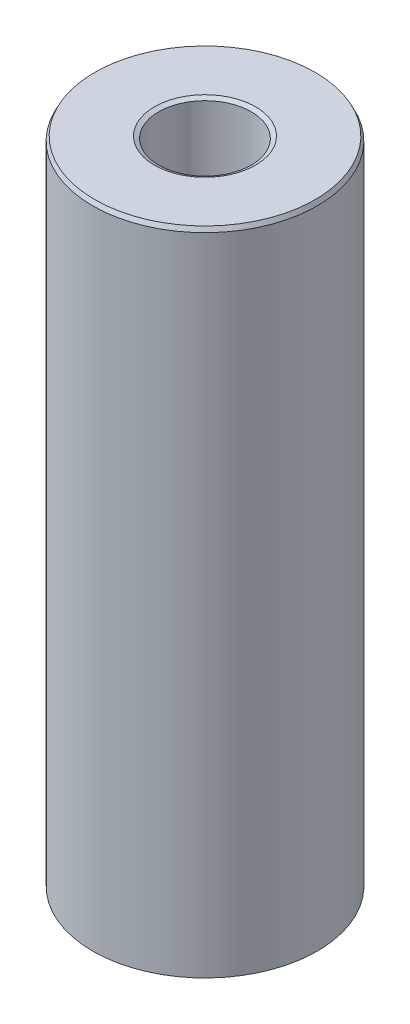
ISO-10303-21;
HEADER;
FILE_DESCRIPTION(('STEP AP214'),'2;1');
FILE_NAME('part.step','',(''),(''),'','','');
FILE_SCHEMA(('AUTOMOTIVE_DESIGN { 1 0 10303 214 1 1 1 1 }'));
ENDSEC;
DATA;
#1=APPLICATION_CONTEXT('core data for automotive mechanical design processes');
#2=APPLICATION_PROTOCOL_DEFINITION('international standard','automotive_design',2000,#1);
#3=PRODUCT_CONTEXT('',#1,'mechanical');
#4=PRODUCT('Part','Part','',(#3));
#5=PRODUCT_RELATED_PRODUCT_CATEGORY('part','',(#4));
#6=PRODUCT_DEFINITION_FORMATION('','',#4);
#7=PRODUCT_DEFINITION_CONTEXT('part definition',#1,'design');
#8=PRODUCT_DEFINITION('design','',#6,#7);
#9=PRODUCT_DEFINITION_SHAPE('','',#8);
#10=(LENGTH_UNIT() NAMED_UNIT(*) SI_UNIT(.MILLI.,.METRE.));
#11=(NAMED_UNIT(*) PLANE_ANGLE_UNIT() SI_UNIT($,.RADIAN.));
#12=(NAMED_UNIT(*) SI_UNIT($,.STERADIAN.) SOLID_ANGLE_UNIT());
#13=UNCERTAINTY_MEASURE_WITH_UNIT(LENGTH_MEASURE(1.E-05),#10,'distance_accuracy_value','');
#14=(GEOMETRIC_REPRESENTATION_CONTEXT(3) GLOBAL_UNCERTAINTY_ASSIGNED_CONTEXT((#13)) GLOBAL_UNIT_ASSIGNED_CONTEXT((#10,
#11,#12)) REPRESENTATION_CONTEXT('',''));
#15=CARTESIAN_POINT('',(0.,0.,0.));
#16=DIRECTION('',(0.,0.,1.));
#17=DIRECTION('',(1.,0.,0.));
#18=AXIS2_PLACEMENT_3D('',#15,#16,#17);
#19=CARTESIAN_POINT('',(0.,188.569213852721,0.));
#20=DIRECTION('',(0.,-1.,0.));
#21=DIRECTION('',(0.,0.,-1.));
#22=AXIS2_PLACEMENT_3D('',#19,#20,#21);
#23=CYLINDRICAL_SURFACE('',#22,32.5);
#24=CARTESIAN_POINT('',(0.,0.614177343072037,0.));
#25=DIRECTION('',(0.,1.,0.));
#26=DIRECTION('',(0.,0.,1.));
#27=AXIS2_PLACEMENT_3D('',#24,#25,#26);
#28=CIRCLE('',#27,32.5);
#29=CARTESIAN_POINT('',(0.,0.614177343072037,32.5));
#30=VERTEX_POINT('',#29);
#31=EDGE_CURVE('E10',#30,#30,#28,.T.);
#32=ORIENTED_EDGE('',*,*,#31,.T.);
#33=EDGE_LOOP('',(#32));
#34=FACE_BOUND('',#33,.T.);
#35=CARTESIAN_POINT('',(0.,187.31958594117,0.));
#36=DIRECTION('',(0.,1.,0.));
#37=DIRECTION('',(0.,0.,1.));
#38=AXIS2_PLACEMENT_3D('',#35,#36,#37);
#39=CIRCLE('',#38,32.5);
#40=CARTESIAN_POINT('',(0.,187.31958594117,32.5));
#41=VERTEX_POINT('',#40);
#42=EDGE_CURVE('E50',#41,#41,#39,.F.);
#43=ORIENTED_EDGE('',*,*,#42,.T.);
#44=EDGE_LOOP('',(#43));
#45=FACE_BOUND('',#44,.T.);
#46=ADVANCED_FACE('F39',(#34,#45),#23,.T.);
#47=CARTESIAN_POINT('',(0.,188.569213852721,0.));
#48=DIRECTION('',(0.,1.,0.));
#49=DIRECTION('',(0.,0.,1.));
#50=AXIS2_PLACEMENT_3D('',#47,#48,#49);
#51=PLANE('',#50);
#52=CARTESIAN_POINT('',(0.,188.569213852721,0.));
#53=DIRECTION('',(0.,1.,0.));
#54=DIRECTION('',(0.,0.,1.));
#55=AXIS2_PLACEMENT_3D('',#52,#53,#54);
#56=CIRCLE('',#55,14.6327961417283);
#57=CARTESIAN_POINT('',(0.,188.569213852721,14.6327961417283));
#58=VERTEX_POINT('',#57);
#59=EDGE_CURVE('E58',#58,#58,#56,.F.);
#60=ORIENTED_EDGE('',*,*,#59,.T.);
#61=EDGE_LOOP('',(#60));
#62=FACE_BOUND('',#61,.T.);
#63=CARTESIAN_POINT('',(0.,188.569213852721,0.));
#64=DIRECTION('',(0.,1.,0.));
#65=DIRECTION('',(0.,0.,1.));
#66=AXIS2_PLACEMENT_3D('',#63,#64,#65);
#67=CIRCLE('',#66,31.8858226569279);
#68=CARTESIAN_POINT('',(0.,188.569213852721,31.8858226569279));
#69=VERTEX_POINT('',#68);
#70=EDGE_CURVE('E61',#69,#69,#67,.T.);
#71=ORIENTED_EDGE('',*,*,#70,.T.);
#72=EDGE_LOOP('',(#71));
#73=FACE_BOUND('',#72,.T.);
#74=ADVANCED_FACE('F88',(#62,#73),#51,.T.);
#75=CARTESIAN_POINT('',(0.,0.,0.));
#76=DIRECTION('',(0.,1.,0.));
#77=DIRECTION('',(0.,0.,1.));
#78=AXIS2_PLACEMENT_3D('',#75,#76,#77);
#79=PLANE('',#78);
#80=CARTESIAN_POINT('',(0.,0.,0.));
#81=DIRECTION('',(0.,1.,0.));
#82=DIRECTION('',(0.,0.,1.));
#83=AXIS2_PLACEMENT_3D('',#80,#81,#82);
#84=CIRCLE('',#83,13.99734557325);
#85=CARTESIAN_POINT('',(0.,0.,13.99734557325));
#86=VERTEX_POINT('',#85);
#87=EDGE_CURVE('E51',#86,#86,#84,.T.);
#88=ORIENTED_EDGE('',*,*,#87,.T.);
#89=EDGE_LOOP('',(#88));
#90=FACE_BOUND('',#89,.T.);
#91=CARTESIAN_POINT('',(0.,0.,0.));
#92=DIRECTION('',(0.,1.,0.));
#93=DIRECTION('',(0.,0.,1.));
#94=AXIS2_PLACEMENT_3D('',#91,#92,#93);
#95=CIRCLE('',#94,31.2503720884496);
#96=CARTESIAN_POINT('',(0.,0.,31.2503720884496));
#97=VERTEX_POINT('',#96);
#98=EDGE_CURVE('E54',#97,#97,#95,.F.);
#99=ORIENTED_EDGE('',*,*,#98,.T.);
#100=EDGE_LOOP('',(#99));
#101=FACE_BOUND('',#100,.T.);
#102=ADVANCED_FACE('F83',(#90,#101),#79,.F.);
#103=CARTESIAN_POINT('',(0.,188.569213852721,0.));
#104=DIRECTION('',(0.,-1.,0.));
#105=DIRECTION('',(0.,0.,-1.));
#106=AXIS2_PLACEMENT_3D('',#103,#104,#105);
#107=CYLINDRICAL_SURFACE('',#106,13.383168230178);
#108=CARTESIAN_POINT('',(0.,187.955036509649,0.));
#109=DIRECTION('',(0.,1.,0.));
#110=DIRECTION('',(0.,0.,1.));
#111=AXIS2_PLACEMENT_3D('',#108,#109,#110);
#112=CIRCLE('',#111,13.383168230178);
#113=CARTESIAN_POINT('',(0.,187.955036509649,13.383168230178));
#114=VERTEX_POINT('',#113);
#115=EDGE_CURVE('E67',#114,#114,#112,.T.);
#116=ORIENTED_EDGE('',*,*,#115,.T.);
#117=EDGE_LOOP('',(#116));
#118=FACE_BOUND('',#117,.T.);
#119=CARTESIAN_POINT('',(0.,1.24962791155039,0.));
#120=DIRECTION('',(0.,1.,0.));
#121=DIRECTION('',(0.,0.,1.));
#122=AXIS2_PLACEMENT_3D('',#119,#120,#121);
#123=CIRCLE('',#122,13.383168230178);
#124=CARTESIAN_POINT('',(0.,1.24962791155039,13.383168230178));
#125=VERTEX_POINT('',#124);
#126=EDGE_CURVE('E69',#125,#125,#123,.F.);
#127=ORIENTED_EDGE('',*,*,#126,.T.);
#128=EDGE_LOOP('',(#127));
#129=FACE_BOUND('',#128,.T.);
#130=ADVANCED_FACE('F71',(#118,#129),#107,.F.);
#131=CARTESIAN_POINT('',(0.,187.955036509649,0.));
#132=DIRECTION('',(0.,1.,0.));
#133=DIRECTION('',(0.,0.,1.));
#134=AXIS2_PLACEMENT_3D('',#131,#132,#133);
#135=CONICAL_SURFACE('',#134,13.383168230178,1.1139813341457);
#136=ORIENTED_EDGE('',*,*,#59,.F.);
#137=EDGE_LOOP('',(#136));
#138=FACE_BOUND('',#137,.T.);
#139=ORIENTED_EDGE('',*,*,#115,.F.);
#140=EDGE_LOOP('',(#139));
#141=FACE_BOUND('',#140,.T.);
#142=ADVANCED_FACE('F77',(#138,#141),#135,.F.);
#143=CARTESIAN_POINT('',(0.,0.,0.));
#144=DIRECTION('',(0.,-1.,0.));
#145=DIRECTION('',(0.,0.,-1.));
#146=AXIS2_PLACEMENT_3D('',#143,#144,#145);
#147=CONICAL_SURFACE('',#146,13.99734557325,0.456814992649182);
#148=ORIENTED_EDGE('',*,*,#126,.F.);
#149=EDGE_LOOP('',(#148));
#150=FACE_BOUND('',#149,.T.);
#151=ORIENTED_EDGE('',*,*,#87,.F.);
#152=EDGE_LOOP('',(#151));
#153=FACE_BOUND('',#152,.T.);
#154=ADVANCED_FACE('F73',(#150,#153),#147,.F.);
#155=CARTESIAN_POINT('',(0.,0.614177343072037,0.));
#156=DIRECTION('',(0.,1.,0.));
#157=DIRECTION('',(0.,0.,1.));
#158=AXIS2_PLACEMENT_3D('',#155,#156,#157);
#159=CONICAL_SURFACE('',#158,32.5,1.11398133414573);
#160=CARTESIAN_POINT('',(0.,0.,31.2503720884496));
#161=CARTESIAN_POINT('',(0.,0.00639768065700028,31.2633890458616));
#162=CARTESIAN_POINT('',(0.,0.0127953613140007,31.2764060032736));
#163=CARTESIAN_POINT('',(0.,0.0255907226280014,31.3024399180976));
#164=CARTESIAN_POINT('',(0.,0.0319884032850018,31.3154568755096));
#165=CARTESIAN_POINT('',(0.,0.0447837645990026,31.3414907903335));
#166=CARTESIAN_POINT('',(0.,0.0511814452560029,31.3545077477455));
#167=CARTESIAN_POINT('',(0.,0.0639768065700037,31.3805416625695));
#168=CARTESIAN_POINT('',(0.,0.0703744872270041,31.3935586199815));
#169=CARTESIAN_POINT('',(0.,0.0831698485410048,31.4195925348054));
#170=CARTESIAN_POINT('',(0.,0.0895675291980052,31.4326094922174));
#171=CARTESIAN_POINT('',(0.,0.102362890512006,31.4586434070414));
#172=CARTESIAN_POINT('',(0.,0.108760571169006,31.4716603644533));
#173=CARTESIAN_POINT('',(0.,0.121555932483007,31.4976942792773));
#174=CARTESIAN_POINT('',(0.,0.127953613140007,31.5107112366893));
#175=CARTESIAN_POINT('',(0.,0.140748974454008,31.5367451515133));
#176=CARTESIAN_POINT('',(0.,0.147146655111009,31.5497621089252));
#177=CARTESIAN_POINT('',(0.,0.159942016425009,31.5757960237492));
#178=CARTESIAN_POINT('',(0.,0.16633969708201,31.5888129811612));
#179=CARTESIAN_POINT('',(0.,0.179135058396011,31.6148468959852));
#180=CARTESIAN_POINT('',(0.,0.185532739053011,31.6278638533971));
#181=CARTESIAN_POINT('',(0.,0.198328100367012,31.6538977682211));
#182=CARTESIAN_POINT('',(0.,0.204725781024012,31.6669147256331));
#183=CARTESIAN_POINT('',(0.,0.217521142338013,31.6929486404571));
#184=CARTESIAN_POINT('',(0.,0.223918822995013,31.705965597869));
#185=CARTESIAN_POINT('',(0.,0.236714184309014,31.731999512693));
#186=CARTESIAN_POINT('',(0.,0.243111864966014,31.745016470105));
#187=CARTESIAN_POINT('',(0.,0.255907226280015,31.771050384929));
#188=CARTESIAN_POINT('',(0.,0.262304906937016,31.7840673423409));
#189=CARTESIAN_POINT('',(0.,0.275100268251016,31.8101012571649));
#190=CARTESIAN_POINT('',(0.,0.281497948908017,31.8231182145769));
#191=CARTESIAN_POINT('',(0.,0.294293310222017,31.8491521294008));
#192=CARTESIAN_POINT('',(0.,0.300690990879018,31.8621690868128));
#193=CARTESIAN_POINT('',(0.,0.313486352193019,31.8882030016368));
#194=CARTESIAN_POINT('',(0.,0.319884032850019,31.9012199590488));
#195=CARTESIAN_POINT('',(0.,0.33267939416402,31.9272538738727));
#196=CARTESIAN_POINT('',(0.,0.33907707482102,31.9402708312847));
#197=CARTESIAN_POINT('',(0.,0.351872436135021,31.9663047461087));
#198=CARTESIAN_POINT('',(0.,0.358270116792021,31.9793217035207));
#199=CARTESIAN_POINT('',(0.,0.371065478106022,32.0053556183446));
#200=CARTESIAN_POINT('',(0.,0.377463158763022,32.0183725757566));
#201=CARTESIAN_POINT('',(0.,0.390258520077023,32.0444064905806));
#202=CARTESIAN_POINT('',(0.,0.396656200734024,32.0574234479926));
#203=CARTESIAN_POINT('',(0.,0.409451562048024,32.0834573628165));
#204=CARTESIAN_POINT('',(0.,0.415849242705025,32.0964743202285));
#205=CARTESIAN_POINT('',(0.,0.428644604019025,32.1225082350525));
#206=CARTESIAN_POINT('',(0.,0.435042284676026,32.1355251924645));
#207=CARTESIAN_POINT('',(0.,0.447837645990027,32.1615591072884));
#208=CARTESIAN_POINT('',(0.,0.454235326647027,32.1745760647004));
#209=CARTESIAN_POINT('',(0.,0.467030687961028,32.2006099795244));
#210=CARTESIAN_POINT('',(0.,0.473428368618028,32.2136269369364));
#211=CARTESIAN_POINT('',(0.,0.486223729932029,32.2396608517603));
#212=CARTESIAN_POINT('',(0.,0.492621410589029,32.2526778091723));
#213=CARTESIAN_POINT('',(0.,0.50541677190303,32.2787117239963));
#214=CARTESIAN_POINT('',(0.,0.51181445256003,32.2917286814083));
#215=CARTESIAN_POINT('',(0.,0.524609813874031,32.3177625962322));
#216=CARTESIAN_POINT('',(0.,0.531007494531032,32.3307795536442));
#217=CARTESIAN_POINT('',(0.,0.543802855845032,32.3568134684682));
#218=CARTESIAN_POINT('',(0.,0.550200536502033,32.3698304258802));
#219=CARTESIAN_POINT('',(0.,0.562995897816033,32.3958643407041));
#220=CARTESIAN_POINT('',(0.,0.569393578473034,32.4088812981161));
#221=CARTESIAN_POINT('',(0.,0.582188939787035,32.4349152129401));
#222=CARTESIAN_POINT('',(0.,0.588586620444035,32.4479321703521));
#223=CARTESIAN_POINT('',(0.,0.601381981758036,32.473966085176));
#224=CARTESIAN_POINT('',(0.,0.607779662415036,32.486983042588));
#225=CARTESIAN_POINT('',(0.,0.614177343072037,32.5));
#226=B_SPLINE_CURVE_WITH_KNOTS('',3,(#160,#161,#162,#163,#164,#165,#166,#167,#168,#169,#170,
#171,#172,#173,#174,#175,#176,#177,#178,#179,#180,#181,#182,#183,#184,#185,#186,#187,#188,#189,
#190,#191,#192,#193,#194,#195,#196,#197,#198,#199,#200,#201,#202,#203,#204,#205,#206,#207,#208,
#209,#210,#211,#212,#213,#214,#215,#216,#217,#218,#219,#220,#221,#222,#223,#224,#225),
.UNSPECIFIED.,.F.,.F.,(4,2,2,2,2,2,2,2,2,2,2,2,2,2,2,2,2,2,2,2,2,2,2,2,2,2,2,2,2,2,2,2,4),(0.,
0.0435125669489749,0.0870251338979497,0.130537700846925,0.174050267795899,0.217562834744874,
0.261075401693849,0.304587968642824,0.348100535591799,0.391613102540774,0.435125669489749,
0.478638236438723,0.522150803387698,0.565663370336673,0.609175937285648,0.652688504234623,
0.696201071183598,0.739713638132573,0.783226205081547,0.826738772030522,0.870251338979497,
0.913763905928472,0.957276472877447,1.00078903982642,1.0443016067754,1.08781417372437,
1.13132674067335,1.17483930762232,1.2183518745713,1.26186444152027,1.30537700846925,
1.34888957541822,1.3924021423672),.UNSPECIFIED.);
#227=EDGE_CURVE('BSEAM76',#97,#30,#226,.T.);
#228=ORIENTED_EDGE('',*,*,#98,.F.);
#229=ORIENTED_EDGE('',*,*,#31,.F.);
#230=ORIENTED_EDGE('',*,*,#227,.T.);
#231=ORIENTED_EDGE('',*,*,#227,.F.);
#232=EDGE_LOOP('',(#228,#230,#229,#231));
#233=FACE_BOUND('',#232,.T.);
#234=ADVANCED_FACE('F76',(#233),#159,.T.);
#235=CARTESIAN_POINT('',(0.,188.569213852721,0.));
#236=DIRECTION('',(0.,-1.,0.));
#237=DIRECTION('',(0.,0.,-1.));
#238=AXIS2_PLACEMENT_3D('',#235,#236,#237);
#239=CONICAL_SURFACE('',#238,31.8858226569279,0.456814992649176);
#240=ORIENTED_EDGE('',*,*,#42,.F.);
#241=EDGE_LOOP('',(#240));
#242=FACE_BOUND('',#241,.T.);
#243=ORIENTED_EDGE('',*,*,#70,.F.);
#244=EDGE_LOOP('',(#243));
#245=FACE_BOUND('',#244,.T.);
#246=ADVANCED_FACE('F45',(#242,#245),#239,.T.);
#247=CLOSED_SHELL('',(#46,#74,#102,#130,#142,#154,#234,#246));
#248=MANIFOLD_SOLID_BREP('B2',#247);
#249=ADVANCED_BREP_SHAPE_REPRESENTATION('',(#18,#248),#14);
#250=SHAPE_DEFINITION_REPRESENTATION(#9,#249);
ENDSEC;
END-ISO-10303-21;
